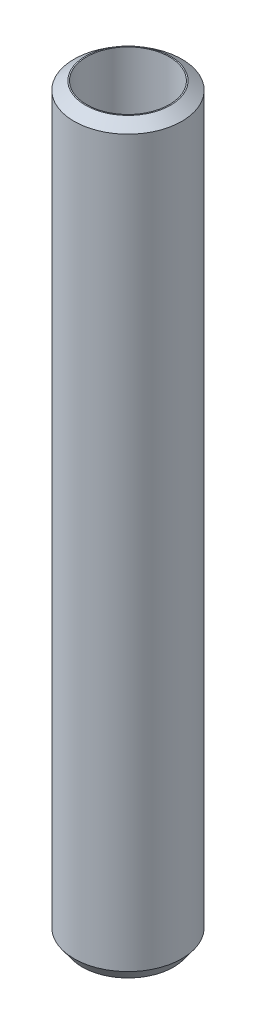
ISO-10303-21;
HEADER;
FILE_DESCRIPTION(('STEP AP214'),'2;1');
FILE_NAME('part.step','',(''),(''),'','','');
FILE_SCHEMA(('AUTOMOTIVE_DESIGN { 1 0 10303 214 1 1 1 1 }'));
ENDSEC;
DATA;
#1=APPLICATION_CONTEXT('core data for automotive mechanical design processes');
#2=APPLICATION_PROTOCOL_DEFINITION('international standard','automotive_design',2000,#1);
#3=PRODUCT_CONTEXT('',#1,'mechanical');
#4=PRODUCT('Part','Part','',(#3));
#5=PRODUCT_RELATED_PRODUCT_CATEGORY('part','',(#4));
#6=PRODUCT_DEFINITION_FORMATION('','',#4);
#7=PRODUCT_DEFINITION_CONTEXT('part definition',#1,'design');
#8=PRODUCT_DEFINITION('design','',#6,#7);
#9=PRODUCT_DEFINITION_SHAPE('','',#8);
#10=(LENGTH_UNIT() NAMED_UNIT(*) SI_UNIT(.MILLI.,.METRE.));
#11=(NAMED_UNIT(*) PLANE_ANGLE_UNIT() SI_UNIT($,.RADIAN.));
#12=(NAMED_UNIT(*) SI_UNIT($,.STERADIAN.) SOLID_ANGLE_UNIT());
#13=UNCERTAINTY_MEASURE_WITH_UNIT(LENGTH_MEASURE(1.E-05),#10,'distance_accuracy_value','');
#14=(GEOMETRIC_REPRESENTATION_CONTEXT(3) GLOBAL_UNCERTAINTY_ASSIGNED_CONTEXT((#13)) GLOBAL_UNIT_ASSIGNED_CONTEXT((#10,
#11,#12)) REPRESENTATION_CONTEXT('',''));
#15=CARTESIAN_POINT('',(0.,0.,0.));
#16=DIRECTION('',(0.,0.,1.));
#17=DIRECTION('',(1.,0.,0.));
#18=AXIS2_PLACEMENT_3D('',#15,#16,#17);
#19=CARTESIAN_POINT('',(0.,310.932394941886,0.));
#20=DIRECTION('',(0.,-1.,0.));
#21=DIRECTION('',(0.,0.,-1.));
#22=AXIS2_PLACEMENT_3D('',#19,#20,#21);
#23=CYLINDRICAL_SURFACE('',#22,22.5);
#24=CARTESIAN_POINT('',(0.,307.502510114243,0.));
#25=DIRECTION('',(0.,1.,0.));
#26=DIRECTION('',(0.,0.,1.));
#27=AXIS2_PLACEMENT_3D('',#24,#25,#26);
#28=CIRCLE('',#27,22.5);
#29=CARTESIAN_POINT('',(0.,307.502510114243,22.5));
#30=VERTEX_POINT('',#29);
#31=EDGE_CURVE('E50',#30,#30,#28,.F.);
#32=ORIENTED_EDGE('',*,*,#31,.T.);
#33=EDGE_LOOP('',(#32));
#34=FACE_BOUND('',#33,.T.);
#35=CARTESIAN_POINT('',(0.,4.74300296555297,0.));
#36=DIRECTION('',(0.,1.,0.));
#37=DIRECTION('',(0.,0.,1.));
#38=AXIS2_PLACEMENT_3D('',#35,#36,#37);
#39=CIRCLE('',#38,22.5);
#40=CARTESIAN_POINT('',(0.,4.74300296555297,22.5));
#41=VERTEX_POINT('',#40);
#42=EDGE_CURVE('E51',#41,#41,#39,.T.);
#43=ORIENTED_EDGE('',*,*,#42,.T.);
#44=EDGE_LOOP('',(#43));
#45=FACE_BOUND('',#44,.T.);
#46=ADVANCED_FACE('F39',(#34,#45),#23,.T.);
#47=CARTESIAN_POINT('',(0.,310.932394941886,0.));
#48=DIRECTION('',(0.,1.,0.));
#49=DIRECTION('',(0.,0.,1.));
#50=AXIS2_PLACEMENT_3D('',#47,#48,#49);
#51=PLANE('',#50);
#52=CARTESIAN_POINT('',(0.,310.932394941886,0.));
#53=DIRECTION('',(0.,1.,0.));
#54=DIRECTION('',(0.,0.,1.));
#55=AXIS2_PLACEMENT_3D('',#52,#53,#54);
#56=CIRCLE('',#55,17.7569970344471);
#57=CARTESIAN_POINT('',(0.,310.932394941886,17.7569970344471));
#58=VERTEX_POINT('',#57);
#59=EDGE_CURVE('E54',#58,#58,#56,.T.);
#60=ORIENTED_EDGE('',*,*,#59,.T.);
#61=EDGE_LOOP('',(#60));
#62=FACE_BOUND('',#61,.T.);
#63=CARTESIAN_POINT('',(0.,310.932394941886,0.));
#64=DIRECTION('',(0.,1.,0.));
#65=DIRECTION('',(0.,0.,1.));
#66=AXIS2_PLACEMENT_3D('',#63,#64,#65);
#67=CIRCLE('',#66,17.2753064393986);
#68=CARTESIAN_POINT('',(0.,310.932394941886,17.2753064393986));
#69=VERTEX_POINT('',#68);
#70=EDGE_CURVE('E58',#69,#69,#67,.T.);
#71=ORIENTED_EDGE('',*,*,#70,.F.);
#72=EDGE_LOOP('',(#71));
#73=FACE_BOUND('',#72,.T.);
#74=ADVANCED_FACE('F69',(#62,#73),#51,.T.);
#75=CARTESIAN_POINT('',(0.,0.,0.));
#76=DIRECTION('',(0.,1.,0.));
#77=DIRECTION('',(0.,0.,1.));
#78=AXIS2_PLACEMENT_3D('',#75,#76,#77);
#79=PLANE('',#78);
#80=CARTESIAN_POINT('',(0.,0.,0.));
#81=DIRECTION('',(0.,1.,0.));
#82=DIRECTION('',(0.,0.,1.));
#83=AXIS2_PLACEMENT_3D('',#80,#81,#82);
#84=CIRCLE('',#83,19.0701151723571);
#85=CARTESIAN_POINT('',(0.,0.,19.0701151723571));
#86=VERTEX_POINT('',#85);
#87=EDGE_CURVE('E10',#86,#86,#84,.F.);
#88=ORIENTED_EDGE('',*,*,#87,.T.);
#89=EDGE_LOOP('',(#88));
#90=FACE_BOUND('',#89,.T.);
#91=CARTESIAN_POINT('',(0.,0.,0.));
#92=DIRECTION('',(0.,1.,0.));
#93=DIRECTION('',(0.,0.,1.));
#94=AXIS2_PLACEMENT_3D('',#91,#92,#93);
#95=CIRCLE('',#94,17.2753064393986);
#96=CARTESIAN_POINT('',(0.,0.,17.2753064393986));
#97=VERTEX_POINT('',#96);
#98=EDGE_CURVE('E63',#97,#97,#95,.T.);
#99=ORIENTED_EDGE('',*,*,#98,.T.);
#100=EDGE_LOOP('',(#99));
#101=FACE_BOUND('',#100,.T.);
#102=ADVANCED_FACE('F75',(#90,#101),#79,.F.);
#103=CARTESIAN_POINT('',(0.,310.932394941886,0.));
#104=DIRECTION('',(0.,-1.,0.));
#105=DIRECTION('',(0.,0.,-1.));
#106=AXIS2_PLACEMENT_3D('',#103,#104,#105);
#107=CYLINDRICAL_SURFACE('',#106,17.2753064393986);
#108=ORIENTED_EDGE('',*,*,#70,.T.);
#109=EDGE_LOOP('',(#108));
#110=FACE_BOUND('',#109,.T.);
#111=ORIENTED_EDGE('',*,*,#98,.F.);
#112=EDGE_LOOP('',(#111));
#113=FACE_BOUND('',#112,.T.);
#114=ADVANCED_FACE('F70',(#110,#113),#107,.F.);
#115=CARTESIAN_POINT('',(0.,310.932394941886,0.));
#116=DIRECTION('',(0.,-1.,0.));
#117=DIRECTION('',(0.,0.,-1.));
#118=AXIS2_PLACEMENT_3D('',#115,#116,#117);
#119=CONICAL_SURFACE('',#118,17.7569970344471,0.94470427836778);
#120=ORIENTED_EDGE('',*,*,#31,.F.);
#121=EDGE_LOOP('',(#120));
#122=FACE_BOUND('',#121,.T.);
#123=ORIENTED_EDGE('',*,*,#59,.F.);
#124=EDGE_LOOP('',(#123));
#125=FACE_BOUND('',#124,.T.);
#126=ADVANCED_FACE('F81',(#122,#125),#119,.T.);
#127=CARTESIAN_POINT('',(0.,4.74300296555297,0.));
#128=DIRECTION('',(0.,1.,0.));
#129=DIRECTION('',(0.,0.,1.));
#130=AXIS2_PLACEMENT_3D('',#127,#128,#129);
#131=CONICAL_SURFACE('',#130,22.5,0.626092048427112);
#132=CARTESIAN_POINT('',(0.,0.,19.0701151723571));
#133=CARTESIAN_POINT('',(0.,0.0494062808911763,19.1058431393117));
#134=CARTESIAN_POINT('',(0.,0.098812561782353,19.1415711062663));
#135=CARTESIAN_POINT('',(0.,0.197625123564706,19.2130270401755));
#136=CARTESIAN_POINT('',(0.,0.247031404455883,19.2487550071302));
#137=CARTESIAN_POINT('',(0.,0.345843966238236,19.3202109410394));
#138=CARTESIAN_POINT('',(0.,0.395250247129413,19.355938907994));
#139=CARTESIAN_POINT('',(0.,0.494062808911766,19.4273948419032));
#140=CARTESIAN_POINT('',(0.,0.543469089802944,19.4631228088578));
#141=CARTESIAN_POINT('',(0.,0.642281651585297,19.5345787427671));
#142=CARTESIAN_POINT('',(0.,0.691687932476473,19.5703067097217));
#143=CARTESIAN_POINT('',(0.,0.790500494258827,19.6417626436309));
#144=CARTESIAN_POINT('',(0.,0.839906775150004,19.6774906105855));
#145=CARTESIAN_POINT('',(0.,0.938719336932357,19.7489465444947));
#146=CARTESIAN_POINT('',(0.,0.988125617823534,19.7846745114494));
#147=CARTESIAN_POINT('',(0.,1.08693817960589,19.8561304453586));
#148=CARTESIAN_POINT('',(0.,1.13634446049706,19.8918584123132));
#149=CARTESIAN_POINT('',(0.,1.23515702227942,19.9633143462224));
#150=CARTESIAN_POINT('',(0.,1.28456330317059,19.999042313177));
#151=CARTESIAN_POINT('',(0.,1.38337586495295,20.0704982470863));
#152=CARTESIAN_POINT('',(0.,1.43278214584412,20.1062262140409));
#153=CARTESIAN_POINT('',(0.,1.53159470762648,20.1776821479501));
#154=CARTESIAN_POINT('',(0.,1.58100098851765,20.2134101149047));
#155=CARTESIAN_POINT('',(0.,1.67981355030001,20.284866048814));
#156=CARTESIAN_POINT('',(0.,1.72921983119119,20.3205940157686));
#157=CARTESIAN_POINT('',(0.,1.82803239297354,20.3920499496778));
#158=CARTESIAN_POINT('',(0.,1.87743867386472,20.4277779166324));
#159=CARTESIAN_POINT('',(0.,1.97625123564707,20.4992338505416));
#160=CARTESIAN_POINT('',(0.,2.02565751653824,20.5349618174963));
#161=CARTESIAN_POINT('',(0.,2.1244700783206,20.6064177514055));
#162=CARTESIAN_POINT('',(0.,2.17387635921178,20.6421457183601));
#163=CARTESIAN_POINT('',(0.,2.27268892099413,20.7136016522693));
#164=CARTESIAN_POINT('',(0.,2.32209520188531,20.7493296192239));
#165=CARTESIAN_POINT('',(0.,2.42090776366766,20.8207855531332));
#166=CARTESIAN_POINT('',(0.,2.47031404455884,20.8565135200878));
#167=CARTESIAN_POINT('',(0.,2.56912660634119,20.927969453997));
#168=CARTESIAN_POINT('',(0.,2.61853288723237,20.9636974209516));
#169=CARTESIAN_POINT('',(0.,2.71734544901472,21.0351533548608));
#170=CARTESIAN_POINT('',(0.,2.7667517299059,21.0708813218155));
#171=CARTESIAN_POINT('',(0.,2.86556429168825,21.1423372557247));
#172=CARTESIAN_POINT('',(0.,2.91497057257943,21.1780652226793));
#173=CARTESIAN_POINT('',(0.,3.01378313436178,21.2495211565885));
#174=CARTESIAN_POINT('',(0.,3.06318941525296,21.2852491235431));
#175=CARTESIAN_POINT('',(0.,3.16200197703531,21.3567050574524));
#176=CARTESIAN_POINT('',(0.,3.21140825792649,21.392433024407));
#177=CARTESIAN_POINT('',(0.,3.31022081970884,21.4638889583162));
#178=CARTESIAN_POINT('',(0.,3.35962710060002,21.4996169252708));
#179=CARTESIAN_POINT('',(0.,3.45843966238237,21.57107285918));
#180=CARTESIAN_POINT('',(0.,3.50784594327355,21.6068008261347));
#181=CARTESIAN_POINT('',(0.,3.6066585050559,21.6782567600439));
#182=CARTESIAN_POINT('',(0.,3.65606478594708,21.7139847269985));
#183=CARTESIAN_POINT('',(0.,3.75487734772943,21.7854406609077));
#184=CARTESIAN_POINT('',(0.,3.80428362862061,21.8211686278623));
#185=CARTESIAN_POINT('',(0.,3.90309619040296,21.8926245617716));
#186=CARTESIAN_POINT('',(0.,3.95250247129414,21.9283525287262));
#187=CARTESIAN_POINT('',(0.,4.05131503307649,21.9998084626354));
#188=CARTESIAN_POINT('',(0.,4.10072131396767,22.03553642959));
#189=CARTESIAN_POINT('',(0.,4.19953387575002,22.1069923634993));
#190=CARTESIAN_POINT('',(0.,4.2489401566412,22.1427203304539));
#191=CARTESIAN_POINT('',(0.,4.34775271842355,22.2141762643631));
#192=CARTESIAN_POINT('',(0.,4.39715899931473,22.2499042313177));
#193=CARTESIAN_POINT('',(0.,4.49597156109708,22.3213601652269));
#194=CARTESIAN_POINT('',(0.,4.54537784198826,22.3570881321815));
#195=CARTESIAN_POINT('',(0.,4.64419040377061,22.4285440660908));
#196=CARTESIAN_POINT('',(0.,4.69359668466179,22.4642720330454));
#197=CARTESIAN_POINT('',(0.,4.74300296555297,22.5));
#198=B_SPLINE_CURVE_WITH_KNOTS('',3,(#132,#133,#134,#135,#136,#137,#138,#139,#140,#141,#142,
#143,#144,#145,#146,#147,#148,#149,#150,#151,#152,#153,#154,#155,#156,#157,#158,#159,#160,#161,
#162,#163,#164,#165,#166,#167,#168,#169,#170,#171,#172,#173,#174,#175,#176,#177,#178,#179,#180,
#181,#182,#183,#184,#185,#186,#187,#188,#189,#190,#191,#192,#193,#194,#195,#196,#197),
.UNSPECIFIED.,.F.,.F.,(4,2,2,2,2,2,2,2,2,2,2,2,2,2,2,2,2,2,2,2,2,2,2,2,2,2,2,2,2,2,2,2,4),(0.,
0.182913132190857,0.365826264381716,0.548739396572575,0.731652528763432,0.914565660954291,
1.09747879314515,1.28039192533601,1.46330505752687,1.64621818971772,1.82913132190858,
2.01204445409944,2.1949575862903,2.37787071848116,2.56078385067202,2.74369698286287,
2.92661011505373,3.10952324724459,3.29243637943545,3.47534951162631,3.65826264381716,
3.84117577600802,4.02408890819888,4.20700204038974,4.3899151725806,4.57282830477145,
4.75574143696231,4.93865456915317,5.12156770134403,5.30448083353489,5.48739396572575,
5.6703070979166,5.85322023010746),.UNSPECIFIED.);
#199=EDGE_CURVE('BSEAM45',#86,#41,#198,.T.);
#200=ORIENTED_EDGE('',*,*,#87,.F.);
#201=ORIENTED_EDGE('',*,*,#42,.F.);
#202=ORIENTED_EDGE('',*,*,#199,.T.);
#203=ORIENTED_EDGE('',*,*,#199,.F.);
#204=EDGE_LOOP('',(#200,#202,#201,#203));
#205=FACE_BOUND('',#204,.T.);
#206=ADVANCED_FACE('F45',(#205),#131,.T.);
#207=CLOSED_SHELL('',(#46,#74,#102,#114,#126,#206));
#208=MANIFOLD_SOLID_BREP('B2',#207);
#209=ADVANCED_BREP_SHAPE_REPRESENTATION('',(#18,#208),#14);
#210=SHAPE_DEFINITION_REPRESENTATION(#9,#209);
ENDSEC;
END-ISO-10303-21;
